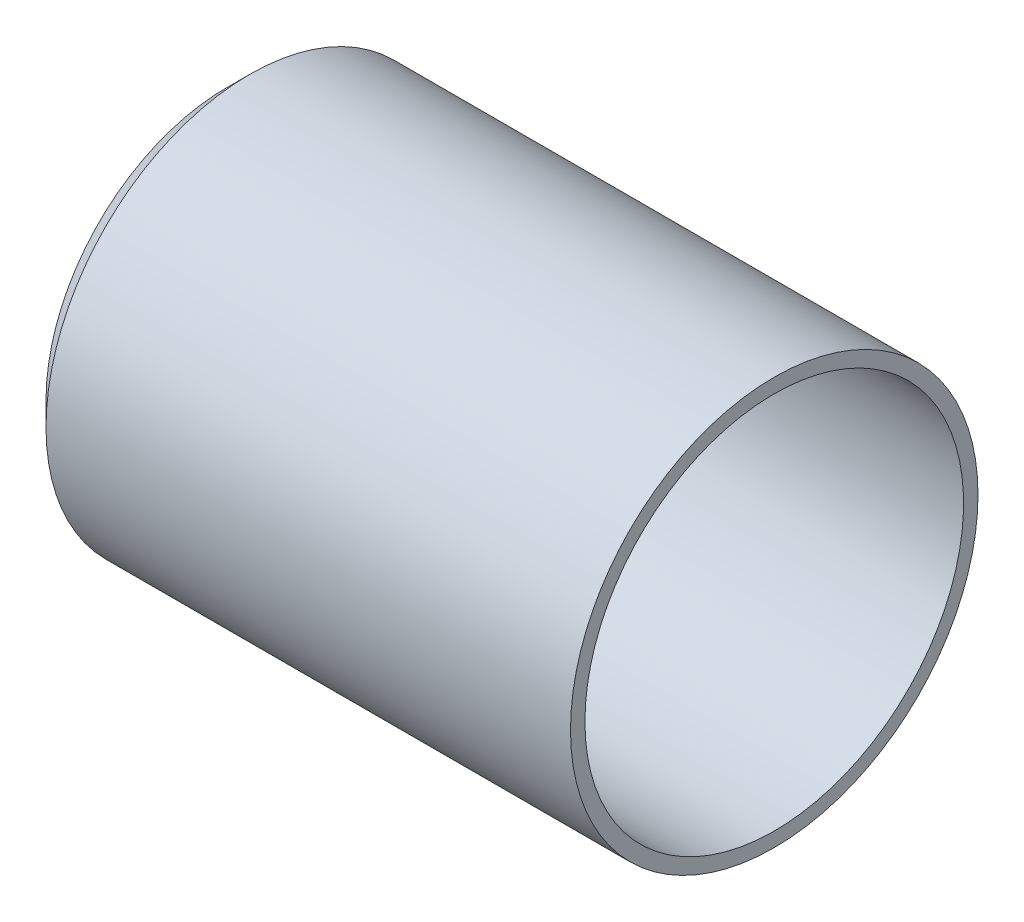
ISO-10303-21;
HEADER;
FILE_DESCRIPTION(('STEP AP214'),'2;1');
FILE_NAME('part.step','',(''),(''),'','','');
FILE_SCHEMA(('AUTOMOTIVE_DESIGN { 1 0 10303 214 1 1 1 1 }'));
ENDSEC;
DATA;
#1=APPLICATION_CONTEXT('core data for automotive mechanical design processes');
#2=APPLICATION_PROTOCOL_DEFINITION('international standard','automotive_design',2000,#1);
#3=PRODUCT_CONTEXT('',#1,'mechanical');
#4=PRODUCT('Part','Part','',(#3));
#5=PRODUCT_RELATED_PRODUCT_CATEGORY('part','',(#4));
#6=PRODUCT_DEFINITION_FORMATION('','',#4);
#7=PRODUCT_DEFINITION_CONTEXT('part definition',#1,'design');
#8=PRODUCT_DEFINITION('design','',#6,#7);
#9=PRODUCT_DEFINITION_SHAPE('','',#8);
#10=(LENGTH_UNIT() NAMED_UNIT(*) SI_UNIT(.MILLI.,.METRE.));
#11=(NAMED_UNIT(*) PLANE_ANGLE_UNIT() SI_UNIT($,.RADIAN.));
#12=(NAMED_UNIT(*) SI_UNIT($,.STERADIAN.) SOLID_ANGLE_UNIT());
#13=UNCERTAINTY_MEASURE_WITH_UNIT(LENGTH_MEASURE(1.E-05),#10,'distance_accuracy_value','');
#14=(GEOMETRIC_REPRESENTATION_CONTEXT(3) GLOBAL_UNCERTAINTY_ASSIGNED_CONTEXT((#13)) GLOBAL_UNIT_ASSIGNED_CONTEXT((#10,
#11,#12)) REPRESENTATION_CONTEXT('',''));
#15=CARTESIAN_POINT('',(0.,0.,0.));
#16=DIRECTION('',(0.,0.,1.));
#17=DIRECTION('',(1.,0.,0.));
#18=AXIS2_PLACEMENT_3D('',#15,#16,#17);
#19=CARTESIAN_POINT('',(1.1829692654717,0.,0.));
#20=DIRECTION('',(1.,0.,0.));
#21=DIRECTION('',(0.,0.,-1.));
#22=AXIS2_PLACEMENT_3D('',#19,#20,#21);
#23=CONICAL_SURFACE('',#22,10.414,0.785398163397448);
#24=CARTESIAN_POINT('',(0.,0.,0.));
#25=DIRECTION('',(-1.,0.,0.));
#26=DIRECTION('',(0.,0.,1.));
#27=AXIS2_PLACEMENT_3D('',#24,#25,#26);
#28=CIRCLE('',#27,9.2310307345283);
#29=CARTESIAN_POINT('',(0.,0.,9.2310307345283));
#30=VERTEX_POINT('',#29);
#31=EDGE_CURVE('E10',#30,#30,#28,.T.);
#32=ORIENTED_EDGE('',*,*,#31,.F.);
#33=EDGE_LOOP('',(#32));
#34=FACE_BOUND('',#33,.T.);
#35=CARTESIAN_POINT('',(1.1829692654717,0.,0.));
#36=DIRECTION('',(-1.,0.,0.));
#37=DIRECTION('',(0.,0.,1.));
#38=AXIS2_PLACEMENT_3D('',#35,#36,#37);
#39=CIRCLE('',#38,10.414);
#40=CARTESIAN_POINT('',(1.1829692654717,0.,10.414));
#41=VERTEX_POINT('',#40);
#42=EDGE_CURVE('E54',#41,#41,#39,.T.);
#43=ORIENTED_EDGE('',*,*,#42,.T.);
#44=EDGE_LOOP('',(#43));
#45=FACE_BOUND('',#44,.T.);
#46=ADVANCED_FACE('F32',(#34,#45),#23,.T.);
#47=CARTESIAN_POINT('',(0.,0.,0.));
#48=DIRECTION('',(-1.,0.,0.));
#49=DIRECTION('',(0.,0.,1.));
#50=AXIS2_PLACEMENT_3D('',#47,#48,#49);
#51=CONICAL_SURFACE('',#50,9.2310307345283,0.785398163397495);
#52=CARTESIAN_POINT('',(0.538815367264151,0.,0.));
#53=DIRECTION('',(-1.,0.,0.));
#54=DIRECTION('',(0.,0.,1.));
#55=AXIS2_PLACEMENT_3D('',#52,#53,#54);
#56=CIRCLE('',#55,8.6922153672641);
#57=CARTESIAN_POINT('',(0.538815367264151,0.,8.6922153672641));
#58=VERTEX_POINT('',#57);
#59=EDGE_CURVE('E38',#58,#58,#56,.T.);
#60=ORIENTED_EDGE('',*,*,#59,.F.);
#61=EDGE_LOOP('',(#60));
#62=FACE_BOUND('',#61,.T.);
#63=ORIENTED_EDGE('',*,*,#31,.T.);
#64=EDGE_LOOP('',(#63));
#65=FACE_BOUND('',#64,.T.);
#66=ADVANCED_FACE('F79',(#62,#65),#51,.F.);
#67=CARTESIAN_POINT('',(0.538815367264151,0.,0.));
#68=DIRECTION('',(1.,0.,0.));
#69=DIRECTION('',(0.,0.,-1.));
#70=AXIS2_PLACEMENT_3D('',#67,#68,#69);
#71=CONICAL_SURFACE('',#70,8.6922153672641,0.785398163397475);
#72=CARTESIAN_POINT('',(1.524,0.,0.));
#73=DIRECTION('',(-1.,0.,0.));
#74=DIRECTION('',(0.,0.,1.));
#75=AXIS2_PLACEMENT_3D('',#72,#73,#74);
#76=CIRCLE('',#75,9.6774);
#77=CARTESIAN_POINT('',(1.524,0.,9.6774));
#78=VERTEX_POINT('',#77);
#79=EDGE_CURVE('E42',#78,#78,#76,.T.);
#80=ORIENTED_EDGE('',*,*,#79,.F.);
#81=EDGE_LOOP('',(#80));
#82=FACE_BOUND('',#81,.T.);
#83=ORIENTED_EDGE('',*,*,#59,.T.);
#84=EDGE_LOOP('',(#83));
#85=FACE_BOUND('',#84,.T.);
#86=ADVANCED_FACE('F74',(#82,#85),#71,.F.);
#87=CARTESIAN_POINT('',(27.9908,0.,0.));
#88=DIRECTION('',(-1.,0.,0.));
#89=DIRECTION('',(0.,0.,1.));
#90=AXIS2_PLACEMENT_3D('',#87,#88,#89);
#91=CYLINDRICAL_SURFACE('',#90,9.6774);
#92=CARTESIAN_POINT('',(27.9908,0.,0.));
#93=DIRECTION('',(-1.,0.,0.));
#94=DIRECTION('',(0.,0.,1.));
#95=AXIS2_PLACEMENT_3D('',#92,#93,#94);
#96=CIRCLE('',#95,9.6774);
#97=CARTESIAN_POINT('',(27.9908,0.,9.6774));
#98=VERTEX_POINT('',#97);
#99=EDGE_CURVE('E46',#98,#98,#96,.T.);
#100=ORIENTED_EDGE('',*,*,#99,.F.);
#101=EDGE_LOOP('',(#100));
#102=FACE_BOUND('',#101,.T.);
#103=ORIENTED_EDGE('',*,*,#79,.T.);
#104=EDGE_LOOP('',(#103));
#105=FACE_BOUND('',#104,.T.);
#106=ADVANCED_FACE('F68',(#102,#105),#91,.F.);
#107=CARTESIAN_POINT('',(27.9908,9.6774,0.));
#108=DIRECTION('',(-1.,0.,0.));
#109=DIRECTION('',(0.,0.,1.));
#110=AXIS2_PLACEMENT_3D('',#107,#108,#109);
#111=PLANE('',#110);
#112=CARTESIAN_POINT('',(27.9908,0.,0.));
#113=DIRECTION('',(-1.,0.,0.));
#114=DIRECTION('',(0.,0.,1.));
#115=AXIS2_PLACEMENT_3D('',#112,#113,#114);
#116=CIRCLE('',#115,10.414);
#117=CARTESIAN_POINT('',(27.9908,0.,10.414));
#118=VERTEX_POINT('',#117);
#119=EDGE_CURVE('E51',#118,#118,#116,.T.);
#120=ORIENTED_EDGE('',*,*,#119,.F.);
#121=EDGE_LOOP('',(#120));
#122=FACE_BOUND('',#121,.T.);
#123=ORIENTED_EDGE('',*,*,#99,.T.);
#124=EDGE_LOOP('',(#123));
#125=FACE_BOUND('',#124,.T.);
#126=ADVANCED_FACE('F62',(#122,#125),#111,.F.);
#127=CARTESIAN_POINT('',(27.9908,0.,0.));
#128=DIRECTION('',(-1.,0.,0.));
#129=DIRECTION('',(0.,0.,1.));
#130=AXIS2_PLACEMENT_3D('',#127,#128,#129);
#131=CYLINDRICAL_SURFACE('',#130,10.414);
#132=ORIENTED_EDGE('',*,*,#42,.F.);
#133=EDGE_LOOP('',(#132));
#134=FACE_BOUND('',#133,.T.);
#135=ORIENTED_EDGE('',*,*,#119,.T.);
#136=EDGE_LOOP('',(#135));
#137=FACE_BOUND('',#136,.T.);
#138=ADVANCED_FACE('F59',(#134,#137),#131,.T.);
#139=CLOSED_SHELL('',(#46,#66,#86,#106,#126,#138));
#140=MANIFOLD_SOLID_BREP('B2',#139);
#141=ADVANCED_BREP_SHAPE_REPRESENTATION('',(#18,#140),#14);
#142=SHAPE_DEFINITION_REPRESENTATION(#9,#141);
ENDSEC;
END-ISO-10303-21;
